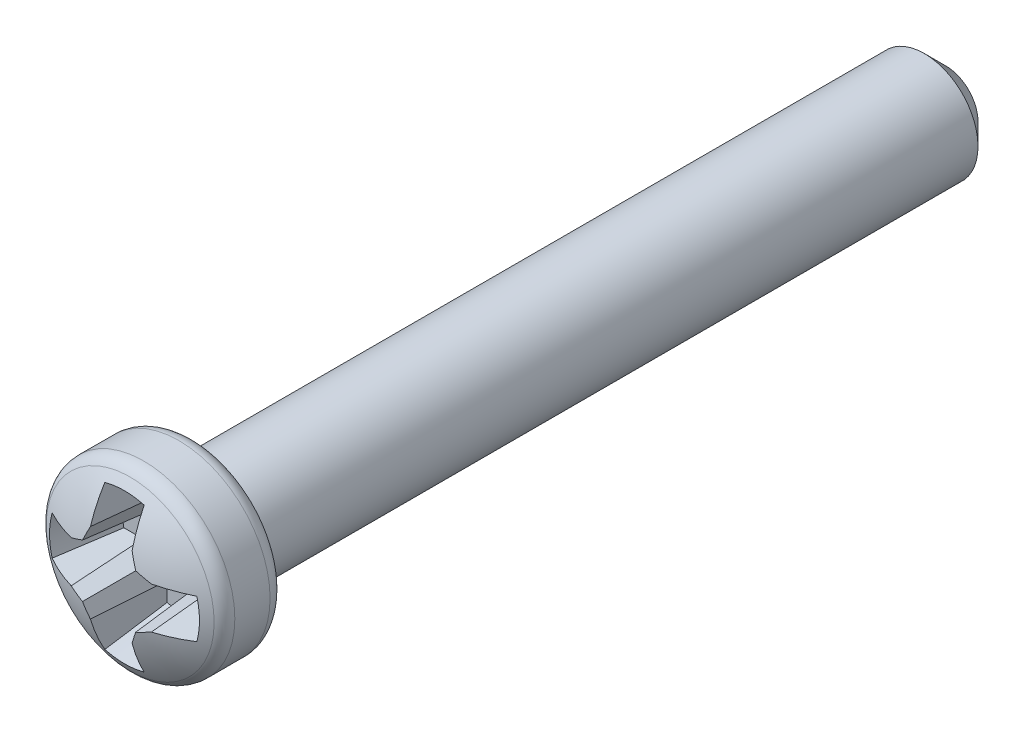
ISO-10303-21;
HEADER;
FILE_DESCRIPTION(('STEP AP214'),'2;1');
FILE_NAME('part.step','',(''),(''),'','','');
FILE_SCHEMA(('AUTOMOTIVE_DESIGN { 1 0 10303 214 1 1 1 1 }'));
ENDSEC;
DATA;
#1=APPLICATION_CONTEXT('core data for automotive mechanical design processes');
#2=APPLICATION_PROTOCOL_DEFINITION('international standard','automotive_design',2000,#1);
#3=PRODUCT_CONTEXT('',#1,'mechanical');
#4=PRODUCT('Part','Part','',(#3));
#5=PRODUCT_RELATED_PRODUCT_CATEGORY('part','',(#4));
#6=PRODUCT_DEFINITION_FORMATION('','',#4);
#7=PRODUCT_DEFINITION_CONTEXT('part definition',#1,'design');
#8=PRODUCT_DEFINITION('design','',#6,#7);
#9=PRODUCT_DEFINITION_SHAPE('','',#8);
#10=(LENGTH_UNIT() NAMED_UNIT(*) SI_UNIT(.MILLI.,.METRE.));
#11=(NAMED_UNIT(*) PLANE_ANGLE_UNIT() SI_UNIT($,.RADIAN.));
#12=(NAMED_UNIT(*) SI_UNIT($,.STERADIAN.) SOLID_ANGLE_UNIT());
#13=UNCERTAINTY_MEASURE_WITH_UNIT(LENGTH_MEASURE(1.E-05),#10,'distance_accuracy_value','');
#14=(GEOMETRIC_REPRESENTATION_CONTEXT(3) GLOBAL_UNCERTAINTY_ASSIGNED_CONTEXT((#13)) GLOBAL_UNIT_ASSIGNED_CONTEXT((#10,
#11,#12)) REPRESENTATION_CONTEXT('',''));
#15=CARTESIAN_POINT('',(0.,0.,0.));
#16=DIRECTION('',(0.,0.,1.));
#17=DIRECTION('',(1.,0.,0.));
#18=AXIS2_PLACEMENT_3D('',#15,#16,#17);
#19=CARTESIAN_POINT('',(-0.400000000000011,0.,15.7));
#20=DIRECTION('',(0.996194698091745,0.,0.0871557427476592));
#21=DIRECTION('',(0.,-1.,-1.20531199141214E-13));
#22=AXIS2_PLACEMENT_3D('',#19,#20,#21);
#23=PLANE('',#22);
#24=CARTESIAN_POINT('',(-0.155769339122426,0.,12.9084307722313));
#25=DIRECTION('',(0.996194698091745,0.,0.0871557427476592));
#26=DIRECTION('',(0.0871557427476592,0.,-0.996194698091745));
#27=AXIS2_PLACEMENT_3D('',#24,#25,#26);
#28=CIRCLE('',#27,2.77353697814506);
#29=CARTESIAN_POINT('',(-0.366942453606423,1.34976675197879,15.3221505157205));
#30=VERTEX_POINT('',#29);
#31=CARTESIAN_POINT('',(-0.388548913673451,0.747722237309709,15.5691134843641));
#32=VERTEX_POINT('',#31);
#33=EDGE_CURVE('E315',#30,#32,#28,.T.);
#34=ORIENTED_EDGE('',*,*,#33,.T.);
#35=DIRECTION('',(-0.0871426484044404,0.0173337504938601,0.996045029063886));
#36=VECTOR('',#35,1.);
#37=CARTESIAN_POINT('',(-0.400815427513501,0.750162198617128,15.7093203791284));
#38=LINE('',#37,#36);
#39=CARTESIAN_POINT('',(-0.273578881205041,0.724853275973701,14.255));
#40=VERTEX_POINT('',#39);
#41=EDGE_CURVE('E11',#40,#32,#38,.T.);
#42=ORIENTED_EDGE('',*,*,#41,.F.);
#43=DIRECTION('',(0.,-1.,0.));
#44=VECTOR('',#43,1.);
#45=CARTESIAN_POINT('',(-0.273578881205049,0.,14.255));
#46=LINE('',#45,#44);
#47=CARTESIAN_POINT('',(-0.273578881205038,1.07866041768189,14.255));
#48=VERTEX_POINT('',#47);
#49=EDGE_CURVE('E397',#48,#40,#46,.T.);
#50=ORIENTED_EDGE('',*,*,#49,.F.);
#51=CARTESIAN_POINT('',(-0.273578881205038,1.07866041768189,14.255));
#52=CARTESIAN_POINT('',(-0.304698622172029,1.16909490040446,14.6107002669011));
#53=CARTESIAN_POINT('',(-0.335820104838195,1.25945048805327,14.9664204415149));
#54=CARTESIAN_POINT('',(-0.366942453606423,1.34976675197879,15.3221505157205));
#55=(BOUNDED_CURVE() B_SPLINE_CURVE(3,(#51,#52,#53,#54),.UNSPECIFIED.,.F.,
.F.) B_SPLINE_CURVE_WITH_KNOTS((4,4),(0.0101147351762878,0.0112197354916044),
.UNSPECIFIED.) CURVE() GEOMETRIC_REPRESENTATION_ITEM() RATIONAL_B_SPLINE_CURVE((1.,1.,1.,1.)) REPRESENTATION_ITEM(''));
#56=EDGE_CURVE('E339',#48,#30,#55,.T.);
#57=ORIENTED_EDGE('',*,*,#56,.T.);
#58=EDGE_LOOP('',(#34,#42,#50,#57));
#59=FACE_BOUND('',#58,.T.);
#60=ADVANCED_FACE('F16',(#59),#23,.T.);
#61=CARTESIAN_POINT('',(-0.606586399182272,0.251256313292342,15.7));
#62=DIRECTION('',(0.920363891963223,-0.381227206369657,0.0871557427476588));
#63=DIRECTION('',(0.,-0.222868776578235,-0.974848454082234));
#64=AXIS2_PLACEMENT_3D('',#61,#62,#63);
#65=PLANE('',#64);
#66=CARTESIAN_POINT('',(-0.379146146396833,0.157047475959057,12.8861548030787));
#67=DIRECTION('',(0.920363891963223,-0.381227206369658,0.0871557427476588));
#68=DIRECTION('',(0.382683432365094,0.923879532511285,0.));
#69=AXIS2_PLACEMENT_3D('',#66,#67,#68);
#70=CIRCLE('',#69,2.74722630506);
#71=CARTESIAN_POINT('',(-0.496473166513852,0.496473166513839,15.6098062018733));
#72=VERTEX_POINT('',#71);
#73=EDGE_CURVE('E428',#32,#72,#70,.T.);
#74=ORIENTED_EDGE('',*,*,#73,.T.);
#75=DIRECTION('',(-0.0666626913468326,0.0666626913468326,0.995546167269401));
#76=VECTOR('',#75,1.);
#77=CARTESIAN_POINT('',(-0.5018585599701,0.501858559970086,15.6902321148732));
#78=LINE('',#77,#76);
#79=CARTESIAN_POINT('',(-0.405754091256932,0.405754091256919,14.255));
#80=VERTEX_POINT('',#79);
#81=EDGE_CURVE('E27',#80,#72,#78,.T.);
#82=ORIENTED_EDGE('',*,*,#81,.F.);
#83=DIRECTION('',(-0.382683432365094,-0.923879532511285,0.));
#84=VECTOR('',#83,1.);
#85=CARTESIAN_POINT('',(-0.489788515050423,0.202877045628466,14.255));
#86=LINE('',#85,#84);
#87=EDGE_CURVE('E244',#40,#80,#86,.T.);
#88=ORIENTED_EDGE('',*,*,#87,.F.);
#89=ORIENTED_EDGE('',*,*,#41,.T.);
#90=EDGE_LOOP('',(#74,#82,#88,#89));
#91=FACE_BOUND('',#90,.T.);
#92=ADVANCED_FACE('F504',(#91),#65,.T.);
#93=CARTESIAN_POINT('',(-0.251256313292353,0.606586399182252,15.7));
#94=DIRECTION('',(0.381227206369636,-0.920363891963232,0.0871557427476579));
#95=DIRECTION('',(0.,-0.0942752822069807,-0.995546167269401));
#96=AXIS2_PLACEMENT_3D('',#93,#94,#95);
#97=PLANE('',#96);
#98=CARTESIAN_POINT('',(-0.157047475959054,0.379146146396823,12.8861548030787));
#99=DIRECTION('',(0.381227206369636,-0.920363891963232,0.0871557427476579));
#100=DIRECTION('',(0.923879532511294,0.382683432365072,0.));
#101=AXIS2_PLACEMENT_3D('',#98,#99,#100);
#102=CIRCLE('',#101,2.74722630506);
#103=CARTESIAN_POINT('',(-0.747722237309725,0.388548913673444,15.5691134843641));
#104=VERTEX_POINT('',#103);
#105=EDGE_CURVE('E422',#72,#104,#102,.T.);
#106=ORIENTED_EDGE('',*,*,#105,.T.);
#107=DIRECTION('',(-0.0173337504938597,0.087142648404439,0.996045029063886));
#108=VECTOR('',#107,1.);
#109=CARTESIAN_POINT('',(-0.74977465582037,0.398867118306383,15.6870511029892));
#110=LINE('',#109,#108);
#111=CARTESIAN_POINT('',(-0.724853275973718,0.273578881205036,14.255));
#112=VERTEX_POINT('',#111);
#113=EDGE_CURVE('E222',#112,#104,#110,.T.);
#114=ORIENTED_EDGE('',*,*,#113,.F.);
#115=DIRECTION('',(-0.923879532511294,-0.382683432365072,0.));
#116=VECTOR('',#115,1.);
#117=CARTESIAN_POINT('',(-0.20287704562845,0.489788515050416,14.255));
#118=LINE('',#117,#116);
#119=EDGE_CURVE('E237',#80,#112,#118,.T.);
#120=ORIENTED_EDGE('',*,*,#119,.F.);
#121=ORIENTED_EDGE('',*,*,#81,.T.);
#122=EDGE_LOOP('',(#106,#114,#120,#121));
#123=FACE_BOUND('',#122,.T.);
#124=ADVANCED_FACE('F509',(#123),#97,.T.);
#125=CARTESIAN_POINT('',(0.,0.399999999999987,15.7));
#126=DIRECTION('',(0.,-0.996194698091746,0.0871557427476576));
#127=DIRECTION('',(-1.,0.,0.));
#128=AXIS2_PLACEMENT_3D('',#125,#126,#127);
#129=PLANE('',#128);
#130=CARTESIAN_POINT('',(0.,0.155769339122407,12.9084307722313));
#131=DIRECTION('',(0.,-0.996194698091746,0.0871557427476576));
#132=DIRECTION('',(0.,-0.0871557427476576,-0.996194698091746));
#133=AXIS2_PLACEMENT_3D('',#130,#131,#132);
#134=CIRCLE('',#133,2.77353697814506);
#135=CARTESIAN_POINT('',(-1.3497667519788,0.366942453606429,15.3221505157205));
#136=VERTEX_POINT('',#135);
#137=EDGE_CURVE('E217',#104,#136,#134,.T.);
#138=ORIENTED_EDGE('',*,*,#137,.T.);
#139=CARTESIAN_POINT('',(-1.07866041768188,0.273578881205039,14.255));
#140=CARTESIAN_POINT('',(-1.16909490040445,0.304698622172032,14.6107002669011));
#141=CARTESIAN_POINT('',(-1.25945048805327,0.335820104838199,14.9664204415149));
#142=CARTESIAN_POINT('',(-1.3497667519788,0.366942453606429,15.3221505157205));
#143=(BOUNDED_CURVE() B_SPLINE_CURVE(3,(#139,#140,#141,#142),.UNSPECIFIED.,.F.,
.F.) B_SPLINE_CURVE_WITH_KNOTS((4,4),(0.00303333154714993,0.00413833274330227),
.UNSPECIFIED.) CURVE() GEOMETRIC_REPRESENTATION_ITEM() RATIONAL_B_SPLINE_CURVE((1.,1.,1.,1.)) REPRESENTATION_ITEM(''));
#144=CARTESIAN_POINT('',(-1.07866041768188,0.273578881205039,14.255));
#145=VERTEX_POINT('',#144);
#146=EDGE_CURVE('E210',#145,#136,#143,.T.);
#147=ORIENTED_EDGE('',*,*,#146,.F.);
#148=DIRECTION('',(-1.,0.,0.));
#149=VECTOR('',#148,1.);
#150=CARTESIAN_POINT('',(0.,0.273578881205028,14.255));
#151=LINE('',#150,#149);
#152=EDGE_CURVE('E214',#112,#145,#151,.T.);
#153=ORIENTED_EDGE('',*,*,#152,.F.);
#154=ORIENTED_EDGE('',*,*,#113,.T.);
#155=EDGE_LOOP('',(#138,#147,#153,#154));
#156=FACE_BOUND('',#155,.T.);
#157=ADVANCED_FACE('F212',(#156),#129,.T.);
#158=CARTESIAN_POINT('',(0.,0.,15.7));
#159=DIRECTION('',(0.,0.,1.));
#160=DIRECTION('',(-1.,0.,0.));
#161=AXIS2_PLACEMENT_3D('',#158,#159,#160);
#162=CONICAL_SURFACE('',#161,1.5,0.26179938779915);
#163=CARTESIAN_POINT('',(0.,0.,15.3221505157205));
#164=DIRECTION('',(0.,0.,1.));
#165=DIRECTION('',(-1.,0.,0.));
#166=AXIS2_PLACEMENT_3D('',#163,#164,#165);
#167=CIRCLE('',#166,1.39875553582679);
#168=CARTESIAN_POINT('',(-1.3497667519788,-0.36694245360644,15.3221505157205));
#169=VERTEX_POINT('',#168);
#170=EDGE_CURVE('E411',#136,#169,#167,.T.);
#171=ORIENTED_EDGE('',*,*,#170,.T.);
#172=CARTESIAN_POINT('',(-1.07866041768189,-0.273578881205053,14.255));
#173=CARTESIAN_POINT('',(-1.16909490040446,-0.304698622172045,14.6107002669011));
#174=CARTESIAN_POINT('',(-1.25945048805328,-0.335820104838211,14.9664204415149));
#175=CARTESIAN_POINT('',(-1.3497667519788,-0.36694245360644,15.3221505157205));
#176=(BOUNDED_CURVE() B_SPLINE_CURVE(3,(#172,#173,#174,#175),.UNSPECIFIED.,.F.,
.F.) B_SPLINE_CURVE_WITH_KNOTS((4,4),(0.0101147351762878,0.0112197354916044),
.UNSPECIFIED.) CURVE() GEOMETRIC_REPRESENTATION_ITEM() RATIONAL_B_SPLINE_CURVE((1.,1.,1.,1.)) REPRESENTATION_ITEM(''));
#177=CARTESIAN_POINT('',(-1.07866041768189,-0.273578881205053,14.255));
#178=VERTEX_POINT('',#177);
#179=EDGE_CURVE('E223',#178,#169,#176,.T.);
#180=ORIENTED_EDGE('',*,*,#179,.F.);
#181=CARTESIAN_POINT('',(0.,0.,14.255));
#182=DIRECTION('',(0.,0.,1.));
#183=DIRECTION('',(1.,0.,0.));
#184=AXIS2_PLACEMENT_3D('',#181,#182,#183);
#185=CIRCLE('',#184,1.11281341693703);
#186=EDGE_CURVE('E226',#145,#178,#185,.T.);
#187=ORIENTED_EDGE('',*,*,#186,.F.);
#188=ORIENTED_EDGE('',*,*,#146,.T.);
#189=EDGE_LOOP('',(#171,#180,#187,#188));
#190=FACE_BOUND('',#189,.T.);
#191=ADVANCED_FACE('F227',(#190),#162,.F.);
#192=CARTESIAN_POINT('',(0.,-0.400000000000023,15.7));
#193=DIRECTION('',(0.,0.996194698091745,0.08715574274766));
#194=DIRECTION('',(1.,0.,0.));
#195=AXIS2_PLACEMENT_3D('',#192,#193,#194);
#196=PLANE('',#195);
#197=CARTESIAN_POINT('',(0.,-0.155769339122436,12.9084307722313));
#198=DIRECTION('',(0.,0.996194698091745,0.08715574274766));
#199=DIRECTION('',(0.,-0.08715574274766,0.996194698091745));
#200=AXIS2_PLACEMENT_3D('',#197,#198,#199);
#201=CIRCLE('',#200,2.77353697814506);
#202=CARTESIAN_POINT('',(-0.74772223730972,-0.388548913673466,15.5691134843641));
#203=VERTEX_POINT('',#202);
#204=EDGE_CURVE('E407',#169,#203,#201,.T.);
#205=ORIENTED_EDGE('',*,*,#204,.T.);
#206=DIRECTION('',(-0.0173337504938606,-0.0871426484044413,0.996045029063886));
#207=VECTOR('',#206,1.);
#208=CARTESIAN_POINT('',(-0.75016219861714,-0.400815427513517,15.7093203791284));
#209=LINE('',#208,#207);
#210=CARTESIAN_POINT('',(-0.724853275973712,-0.273578881205055,14.255));
#211=VERTEX_POINT('',#210);
#212=EDGE_CURVE('E303',#211,#203,#209,.T.);
#213=ORIENTED_EDGE('',*,*,#212,.F.);
#214=DIRECTION('',(1.,0.,0.));
#215=VECTOR('',#214,1.);
#216=CARTESIAN_POINT('',(0.,-0.27357888120506,14.255));
#217=LINE('',#216,#215);
#218=EDGE_CURVE('E232',#178,#211,#217,.T.);
#219=ORIENTED_EDGE('',*,*,#218,.F.);
#220=ORIENTED_EDGE('',*,*,#179,.T.);
#221=EDGE_LOOP('',(#205,#213,#219,#220));
#222=FACE_BOUND('',#221,.T.);
#223=ADVANCED_FACE('F818',(#222),#196,.T.);
#224=CARTESIAN_POINT('',(-0.251256313292352,-0.606586399182285,15.7));
#225=DIRECTION('',(0.381227206369654,0.920363891963224,0.0871557427476598));
#226=DIRECTION('',(0.22286877657824,0.,-0.974848454082233));
#227=AXIS2_PLACEMENT_3D('',#224,#225,#226);
#228=PLANE('',#227);
#229=CARTESIAN_POINT('',(-0.157047475959065,-0.379146146396845,12.8861548030787));
#230=DIRECTION('',(0.381227206369653,0.920363891963224,0.0871557427476598));
#231=DIRECTION('',(-0.923879532511287,0.38268343236509,0.));
#232=AXIS2_PLACEMENT_3D('',#229,#230,#231);
#233=CIRCLE('',#232,2.74722630506);
#234=CARTESIAN_POINT('',(-0.49647316651385,-0.496473166513867,15.6098062018733));
#235=VERTEX_POINT('',#234);
#236=EDGE_CURVE('E412',#203,#235,#233,.T.);
#237=ORIENTED_EDGE('',*,*,#236,.T.);
#238=DIRECTION('',(-0.0666626913468331,-0.0666626913468336,0.995546167269401));
#239=VECTOR('',#238,1.);
#240=CARTESIAN_POINT('',(-0.501858559970097,-0.501858559970114,15.6902321148732));
#241=LINE('',#240,#239);
#242=CARTESIAN_POINT('',(-0.405754091256929,-0.405754091256945,14.255));
#243=VERTEX_POINT('',#242);
#244=EDGE_CURVE('E261',#243,#235,#241,.T.);
#245=ORIENTED_EDGE('',*,*,#244,.F.);
#246=DIRECTION('',(0.923879532511287,-0.38268343236509,0.));
#247=VECTOR('',#246,1.);
#248=CARTESIAN_POINT('',(-0.20287704562847,-0.489788515050438,14.255));
#249=LINE('',#248,#247);
#250=EDGE_CURVE('E252',#211,#243,#249,.T.);
#251=ORIENTED_EDGE('',*,*,#250,.F.);
#252=ORIENTED_EDGE('',*,*,#212,.T.);
#253=EDGE_LOOP('',(#237,#245,#251,#252));
#254=FACE_BOUND('',#253,.T.);
#255=ADVANCED_FACE('F586',(#254),#228,.T.);
#256=CARTESIAN_POINT('',(-0.606586399182264,-0.251256313292368,15.7));
#257=DIRECTION('',(0.920363891963231,0.381227206369638,0.087155742747659));
#258=DIRECTION('',(0.,0.222868776578246,-0.974848454082231));
#259=AXIS2_PLACEMENT_3D('',#256,#257,#258);
#260=PLANE('',#259);
#261=CARTESIAN_POINT('',(-0.379146146396833,-0.157047475959064,12.8861548030787));
#262=DIRECTION('',(0.92036389196323,0.381227206369639,0.087155742747659));
#263=DIRECTION('',(-0.382683432365075,0.923879532511293,0.));
#264=AXIS2_PLACEMENT_3D('',#261,#262,#263);
#265=CIRCLE('',#264,2.74722630506);
#266=CARTESIAN_POINT('',(-0.388548913673453,-0.747722237309739,15.5691134843641));
#267=VERTEX_POINT('',#266);
#268=EDGE_CURVE('E20',#235,#267,#265,.T.);
#269=ORIENTED_EDGE('',*,*,#268,.T.);
#270=DIRECTION('',(-0.0871426484044398,-0.0173337504938608,0.996045029063886));
#271=VECTOR('',#270,1.);
#272=CARTESIAN_POINT('',(-0.398867118306393,-0.749774655820384,15.6870511029892));
#273=LINE('',#272,#271);
#274=CARTESIAN_POINT('',(-0.273578881205045,-0.724853275973731,14.255));
#275=VERTEX_POINT('',#274);
#276=EDGE_CURVE('E257',#275,#267,#273,.T.);
#277=ORIENTED_EDGE('',*,*,#276,.F.);
#278=DIRECTION('',(0.382683432365075,-0.923879532511293,0.));
#279=VECTOR('',#278,1.);
#280=CARTESIAN_POINT('',(-0.48978851505043,-0.202877045628457,14.255));
#281=LINE('',#280,#279);
#282=EDGE_CURVE('E256',#243,#275,#281,.T.);
#283=ORIENTED_EDGE('',*,*,#282,.F.);
#284=ORIENTED_EDGE('',*,*,#244,.T.);
#285=EDGE_LOOP('',(#269,#277,#283,#284));
#286=FACE_BOUND('',#285,.T.);
#287=ADVANCED_FACE('F583',(#286),#260,.T.);
#288=CARTESIAN_POINT('',(-0.4,0.,15.7));
#289=DIRECTION('',(0.996194698091746,0.,0.0871557427476584));
#290=DIRECTION('',(0.,-1.,0.));
#291=AXIS2_PLACEMENT_3D('',#288,#289,#290);
#292=PLANE('',#291);
#293=CARTESIAN_POINT('',(-0.155769339122418,0.,12.9084307722313));
#294=DIRECTION('',(0.996194698091746,0.,0.0871557427476584));
#295=DIRECTION('',(0.0871557427476584,0.,-0.996194698091746));
#296=AXIS2_PLACEMENT_3D('',#293,#294,#295);
#297=CIRCLE('',#296,2.77353697814506);
#298=CARTESIAN_POINT('',(-0.366942453606437,-1.34976675197881,15.3221505157205));
#299=VERTEX_POINT('',#298);
#300=EDGE_CURVE('E379',#267,#299,#297,.T.);
#301=ORIENTED_EDGE('',*,*,#300,.T.);
#302=CARTESIAN_POINT('',(-0.273578881205047,-1.07866041768189,14.255));
#303=CARTESIAN_POINT('',(-0.304698622172039,-1.16909490040447,14.6107002669011));
#304=CARTESIAN_POINT('',(-0.335820104838207,-1.25945048805328,14.9664204415149));
#305=CARTESIAN_POINT('',(-0.366942453606437,-1.34976675197881,15.3221505157205));
#306=(BOUNDED_CURVE() B_SPLINE_CURVE(3,(#302,#303,#304,#305),.UNSPECIFIED.,.F.,
.F.) B_SPLINE_CURVE_WITH_KNOTS((4,4),(0.00303333154714993,0.00413833274330227),
.UNSPECIFIED.) CURVE() GEOMETRIC_REPRESENTATION_ITEM() RATIONAL_B_SPLINE_CURVE((1.,1.,1.,1.)) REPRESENTATION_ITEM(''));
#307=CARTESIAN_POINT('',(-0.273578881205047,-1.07866041768189,14.255));
#308=VERTEX_POINT('',#307);
#309=EDGE_CURVE('E384',#308,#299,#306,.T.);
#310=ORIENTED_EDGE('',*,*,#309,.F.);
#311=DIRECTION('',(0.,-1.,0.));
#312=VECTOR('',#311,1.);
#313=CARTESIAN_POINT('',(-0.27357888120504,0.,14.255));
#314=LINE('',#313,#312);
#315=EDGE_CURVE('E413',#275,#308,#314,.T.);
#316=ORIENTED_EDGE('',*,*,#315,.F.);
#317=ORIENTED_EDGE('',*,*,#276,.T.);
#318=EDGE_LOOP('',(#301,#310,#316,#317));
#319=FACE_BOUND('',#318,.T.);
#320=ADVANCED_FACE('F585',(#319),#292,.T.);
#321=CARTESIAN_POINT('',(0.400000000000011,0.,15.7));
#322=DIRECTION('',(-0.996194698091745,0.,0.0871557427476592));
#323=DIRECTION('',(0.,1.,0.));
#324=AXIS2_PLACEMENT_3D('',#321,#322,#323);
#325=PLANE('',#324);
#326=CARTESIAN_POINT('',(0.155769339122426,0.,12.9084307722313));
#327=DIRECTION('',(-0.996194698091745,0.,0.0871557427476592));
#328=DIRECTION('',(0.0871557427476592,0.,0.996194698091745));
#329=AXIS2_PLACEMENT_3D('',#326,#327,#328);
#330=CIRCLE('',#329,2.77353697814506);
#331=CARTESIAN_POINT('',(0.366942453606433,-1.34976675197881,15.3221505157205));
#332=VERTEX_POINT('',#331);
#333=CARTESIAN_POINT('',(0.388548913673456,-0.747722237309731,15.5691134843641));
#334=VERTEX_POINT('',#333);
#335=EDGE_CURVE('E360',#332,#334,#330,.T.);
#336=ORIENTED_EDGE('',*,*,#335,.T.);
#337=DIRECTION('',(0.0871426484044404,-0.0173337504938611,0.996045029063886));
#338=VECTOR('',#337,1.);
#339=CARTESIAN_POINT('',(0.400815427513507,-0.750162198617151,15.7093203791284));
#340=LINE('',#339,#338);
#341=CARTESIAN_POINT('',(0.273578881205046,-0.724853275973723,14.255));
#342=VERTEX_POINT('',#341);
#343=EDGE_CURVE('E262',#342,#334,#340,.T.);
#344=ORIENTED_EDGE('',*,*,#343,.F.);
#345=DIRECTION('',(0.,1.,0.));
#346=VECTOR('',#345,1.);
#347=CARTESIAN_POINT('',(0.273578881205049,0.,14.255));
#348=LINE('',#347,#346);
#349=CARTESIAN_POINT('',(0.273578881205045,-1.0786604176819,14.255));
#350=VERTEX_POINT('',#349);
#351=EDGE_CURVE('E353',#350,#342,#348,.T.);
#352=ORIENTED_EDGE('',*,*,#351,.F.);
#353=CARTESIAN_POINT('',(0.273578881205045,-1.0786604176819,14.255));
#354=CARTESIAN_POINT('',(0.304698622172037,-1.16909490040448,14.6107002669011));
#355=CARTESIAN_POINT('',(0.335820104838204,-1.25945048805329,14.9664204415149));
#356=CARTESIAN_POINT('',(0.366942453606433,-1.34976675197881,15.3221505157205));
#357=(BOUNDED_CURVE() B_SPLINE_CURVE(3,(#353,#354,#355,#356),.UNSPECIFIED.,.F.,
.F.) B_SPLINE_CURVE_WITH_KNOTS((4,4),(0.0101147351762878,0.0112197354916044),
.UNSPECIFIED.) CURVE() GEOMETRIC_REPRESENTATION_ITEM() RATIONAL_B_SPLINE_CURVE((1.,1.,1.,1.)) REPRESENTATION_ITEM(''));
#358=EDGE_CURVE('E323',#350,#332,#357,.T.);
#359=ORIENTED_EDGE('',*,*,#358,.T.);
#360=EDGE_LOOP('',(#336,#344,#352,#359));
#361=FACE_BOUND('',#360,.T.);
#362=ADVANCED_FACE('F841',(#361),#325,.T.);
#363=CARTESIAN_POINT('',(0.606586399182273,-0.251256313292363,15.7));
#364=DIRECTION('',(-0.920363891963225,0.381227206369651,0.0871557427476594));
#365=DIRECTION('',(0.094275282206983,0.,0.995546167269401));
#366=AXIS2_PLACEMENT_3D('',#363,#364,#365);
#367=PLANE('',#366);
#368=CARTESIAN_POINT('',(0.379146146396836,-0.157047475959071,12.8861548030787));
#369=DIRECTION('',(-0.920363891963225,0.38122720636965,0.0871557427476594));
#370=DIRECTION('',(-0.382683432365087,-0.923879532511288,0.));
#371=AXIS2_PLACEMENT_3D('',#368,#369,#370);
#372=CIRCLE('',#371,2.74722630506);
#373=CARTESIAN_POINT('',(0.496473166513856,-0.496473166513861,15.6098062018733));
#374=VERTEX_POINT('',#373);
#375=EDGE_CURVE('E368',#334,#374,#372,.T.);
#376=ORIENTED_EDGE('',*,*,#375,.T.);
#377=DIRECTION('',(0.066662691346833,-0.0666626913468337,0.995546167269401));
#378=VECTOR('',#377,1.);
#379=CARTESIAN_POINT('',(0.501858559970103,-0.501858559970108,15.6902321148732));
#380=LINE('',#379,#378);
#381=CARTESIAN_POINT('',(0.405754091256935,-0.405754091256939,14.255));
#382=VERTEX_POINT('',#381);
#383=EDGE_CURVE('E41',#382,#374,#380,.T.);
#384=ORIENTED_EDGE('',*,*,#383,.F.);
#385=DIRECTION('',(0.382683432365087,0.923879532511288,0.));
#386=VECTOR('',#385,1.);
#387=CARTESIAN_POINT('',(0.489788515050433,-0.202877045628466,14.255));
#388=LINE('',#387,#386);
#389=EDGE_CURVE('E348',#342,#382,#388,.T.);
#390=ORIENTED_EDGE('',*,*,#389,.F.);
#391=ORIENTED_EDGE('',*,*,#343,.T.);
#392=EDGE_LOOP('',(#376,#384,#390,#391));
#393=FACE_BOUND('',#392,.T.);
#394=ADVANCED_FACE('F839',(#393),#367,.T.);
#395=CARTESIAN_POINT('',(0.251256313292357,-0.606586399182276,15.7));
#396=DIRECTION('',(-0.381227206369642,0.920363891963229,0.0871557427476594));
#397=DIRECTION('',(0.222868776578245,0.,0.974848454082231));
#398=AXIS2_PLACEMENT_3D('',#395,#396,#397);
#399=PLANE('',#398);
#400=CARTESIAN_POINT('',(0.157047475959058,-0.379146146396842,12.8861548030787));
#401=DIRECTION('',(-0.381227206369641,0.920363891963229,0.0871557427476594));
#402=DIRECTION('',(-0.923879532511292,-0.382683432365078,0.));
#403=AXIS2_PLACEMENT_3D('',#400,#401,#402);
#404=CIRCLE('',#403,2.74722630506);
#405=CARTESIAN_POINT('',(0.747722237309727,-0.388548913673463,15.5691134843641));
#406=VERTEX_POINT('',#405);
#407=EDGE_CURVE('E272',#374,#406,#404,.T.);
#408=ORIENTED_EDGE('',*,*,#407,.T.);
#409=DIRECTION('',(0.0173337504938603,-0.0871426484044405,0.996045029063886));
#410=VECTOR('',#409,1.);
#411=CARTESIAN_POINT('',(0.749774655820373,-0.398867118306403,15.6870511029892));
#412=LINE('',#411,#410);
#413=CARTESIAN_POINT('',(0.72485327597372,-0.273578881205054,14.255));
#414=VERTEX_POINT('',#413);
#415=EDGE_CURVE('E282',#414,#406,#412,.T.);
#416=ORIENTED_EDGE('',*,*,#415,.F.);
#417=DIRECTION('',(0.923879532511292,0.382683432365078,0.));
#418=VECTOR('',#417,1.);
#419=CARTESIAN_POINT('',(0.202877045628462,-0.489788515050434,14.255));
#420=LINE('',#419,#418);
#421=EDGE_CURVE('E352',#382,#414,#420,.T.);
#422=ORIENTED_EDGE('',*,*,#421,.F.);
#423=ORIENTED_EDGE('',*,*,#383,.T.);
#424=EDGE_LOOP('',(#408,#416,#422,#423));
#425=FACE_BOUND('',#424,.T.);
#426=ADVANCED_FACE('F829',(#425),#399,.T.);
#427=CARTESIAN_POINT('',(0.,-0.400000000000013,15.7));
#428=DIRECTION('',(0.,0.996194698091745,0.0871557427476592));
#429=DIRECTION('',(1.,0.,0.));
#430=AXIS2_PLACEMENT_3D('',#427,#428,#429);
#431=PLANE('',#430);
#432=CARTESIAN_POINT('',(0.,-0.155769339122428,12.9084307722313));
#433=DIRECTION('',(0.,0.996194698091745,0.0871557427476592));
#434=DIRECTION('',(0.,-0.0871557427476592,0.996194698091745));
#435=AXIS2_PLACEMENT_3D('',#432,#433,#434);
#436=CIRCLE('',#435,2.77353697814506);
#437=CARTESIAN_POINT('',(1.3497667519788,-0.366942453606444,15.3221505157205));
#438=VERTEX_POINT('',#437);
#439=EDGE_CURVE('E268',#406,#438,#436,.T.);
#440=ORIENTED_EDGE('',*,*,#439,.T.);
#441=CARTESIAN_POINT('',(1.07866041768188,-0.273578881205055,14.255));
#442=CARTESIAN_POINT('',(1.16909490040446,-0.304698622172047,14.6107002669011));
#443=CARTESIAN_POINT('',(1.25945048805327,-0.335820104838214,14.9664204415149));
#444=CARTESIAN_POINT('',(1.3497667519788,-0.366942453606444,15.3221505157205));
#445=(BOUNDED_CURVE() B_SPLINE_CURVE(3,(#441,#442,#443,#444),.UNSPECIFIED.,.F.,
.F.) B_SPLINE_CURVE_WITH_KNOTS((4,4),(0.00303333154714993,0.00413833274330227),
.UNSPECIFIED.) CURVE() GEOMETRIC_REPRESENTATION_ITEM() RATIONAL_B_SPLINE_CURVE((1.,1.,1.,1.)) REPRESENTATION_ITEM(''));
#446=CARTESIAN_POINT('',(1.07866041768188,-0.273578881205055,14.255));
#447=VERTEX_POINT('',#446);
#448=EDGE_CURVE('E322',#447,#438,#445,.T.);
#449=ORIENTED_EDGE('',*,*,#448,.F.);
#450=DIRECTION('',(1.,0.,0.));
#451=VECTOR('',#450,1.);
#452=CARTESIAN_POINT('',(0.,-0.273578881205051,14.255));
#453=LINE('',#452,#451);
#454=EDGE_CURVE('E330',#414,#447,#453,.T.);
#455=ORIENTED_EDGE('',*,*,#454,.F.);
#456=ORIENTED_EDGE('',*,*,#415,.T.);
#457=EDGE_LOOP('',(#440,#449,#455,#456));
#458=FACE_BOUND('',#457,.T.);
#459=ADVANCED_FACE('F599',(#458),#431,.T.);
#460=CARTESIAN_POINT('',(0.,0.,14.255));
#461=DIRECTION('',(0.,0.,1.));
#462=DIRECTION('',(1.,0.,0.));
#463=AXIS2_PLACEMENT_3D('',#460,#461,#462);
#464=PLANE('',#463);
#465=ORIENTED_EDGE('',*,*,#454,.T.);
#466=CARTESIAN_POINT('',(0.,0.,14.255));
#467=DIRECTION('',(0.,0.,1.));
#468=DIRECTION('',(1.,0.,0.));
#469=AXIS2_PLACEMENT_3D('',#466,#467,#468);
#470=CIRCLE('',#469,1.11281341693703);
#471=CARTESIAN_POINT('',(1.07866041768189,0.273578881205037,14.255));
#472=VERTEX_POINT('',#471);
#473=EDGE_CURVE('E318',#447,#472,#470,.T.);
#474=ORIENTED_EDGE('',*,*,#473,.T.);
#475=DIRECTION('',(-1.,0.,0.));
#476=VECTOR('',#475,1.);
#477=CARTESIAN_POINT('',(0.,0.273578881205037,14.255));
#478=LINE('',#477,#476);
#479=CARTESIAN_POINT('',(0.72485327597371,0.273578881205037,14.255));
#480=VERTEX_POINT('',#479);
#481=EDGE_CURVE('E327',#472,#480,#478,.T.);
#482=ORIENTED_EDGE('',*,*,#481,.T.);
#483=DIRECTION('',(-0.923879532511289,0.382683432365084,0.));
#484=VECTOR('',#483,1.);
#485=CARTESIAN_POINT('',(0.202877045628459,0.489788515050419,14.255));
#486=LINE('',#485,#484);
#487=CARTESIAN_POINT('',(0.405754091256926,0.405754091256924,14.255));
#488=VERTEX_POINT('',#487);
#489=EDGE_CURVE('E248',#480,#488,#486,.T.);
#490=ORIENTED_EDGE('',*,*,#489,.T.);
#491=DIRECTION('',(-0.382683432365081,0.92387953251129,0.));
#492=VECTOR('',#491,1.);
#493=CARTESIAN_POINT('',(0.48978851505042,0.202877045628457,14.255));
#494=LINE('',#493,#492);
#495=CARTESIAN_POINT('',(0.273578881205039,0.724853275973709,14.255));
#496=VERTEX_POINT('',#495);
#497=EDGE_CURVE('E266',#488,#496,#494,.T.);
#498=ORIENTED_EDGE('',*,*,#497,.T.);
#499=DIRECTION('',(0.,1.,0.));
#500=VECTOR('',#499,1.);
#501=CARTESIAN_POINT('',(0.27357888120504,0.,14.255));
#502=LINE('',#501,#500);
#503=CARTESIAN_POINT('',(0.273578881205039,1.07866041768189,14.255));
#504=VERTEX_POINT('',#503);
#505=EDGE_CURVE('E267',#496,#504,#502,.T.);
#506=ORIENTED_EDGE('',*,*,#505,.T.);
#507=CARTESIAN_POINT('',(0.,0.,14.255));
#508=DIRECTION('',(0.,0.,1.));
#509=DIRECTION('',(1.,0.,0.));
#510=AXIS2_PLACEMENT_3D('',#507,#508,#509);
#511=CIRCLE('',#510,1.11281341693703);
#512=EDGE_CURVE('E288',#504,#48,#511,.T.);
#513=ORIENTED_EDGE('',*,*,#512,.T.);
#514=ORIENTED_EDGE('',*,*,#49,.T.);
#515=ORIENTED_EDGE('',*,*,#87,.T.);
#516=ORIENTED_EDGE('',*,*,#119,.T.);
#517=ORIENTED_EDGE('',*,*,#152,.T.);
#518=ORIENTED_EDGE('',*,*,#186,.T.);
#519=ORIENTED_EDGE('',*,*,#218,.T.);
#520=ORIENTED_EDGE('',*,*,#250,.T.);
#521=ORIENTED_EDGE('',*,*,#282,.T.);
#522=ORIENTED_EDGE('',*,*,#315,.T.);
#523=CARTESIAN_POINT('',(0.,0.,14.255));
#524=DIRECTION('',(0.,0.,1.));
#525=DIRECTION('',(1.,0.,0.));
#526=AXIS2_PLACEMENT_3D('',#523,#524,#525);
#527=CIRCLE('',#526,1.11281341693703);
#528=EDGE_CURVE('E391',#308,#350,#527,.T.);
#529=ORIENTED_EDGE('',*,*,#528,.T.);
#530=ORIENTED_EDGE('',*,*,#351,.T.);
#531=ORIENTED_EDGE('',*,*,#389,.T.);
#532=ORIENTED_EDGE('',*,*,#421,.T.);
#533=EDGE_LOOP('',(#465,#474,#482,#490,#498,#506,#513,#514,#515,#516,#517,#518,#519,#520,#521,
#522,#529,#530,#531,#532));
#534=FACE_BOUND('',#533,.T.);
#535=ADVANCED_FACE('F234',(#534),#464,.T.);
#536=CARTESIAN_POINT('',(0.,0.4,15.7));
#537=DIRECTION('',(0.,-0.996194698091746,0.0871557427476584));
#538=DIRECTION('',(-1.,0.,0.));
#539=AXIS2_PLACEMENT_3D('',#536,#537,#538);
#540=PLANE('',#539);
#541=CARTESIAN_POINT('',(0.,0.155769339122415,12.9084307722313));
#542=DIRECTION('',(0.,-0.996194698091746,0.0871557427476584));
#543=DIRECTION('',(0.,-0.0871557427476584,-0.996194698091746));
#544=AXIS2_PLACEMENT_3D('',#541,#542,#543);
#545=CIRCLE('',#544,2.77353697814506);
#546=CARTESIAN_POINT('',(1.3497667519788,0.366942453606425,15.3221505157205));
#547=VERTEX_POINT('',#546);
#548=CARTESIAN_POINT('',(0.747722237309717,0.388548913673446,15.5691134843641));
#549=VERTEX_POINT('',#548);
#550=EDGE_CURVE('E402',#547,#549,#545,.T.);
#551=ORIENTED_EDGE('',*,*,#550,.T.);
#552=DIRECTION('',(0.0173337504938599,0.0871426484044397,0.996045029063886));
#553=VECTOR('',#552,1.);
#554=CARTESIAN_POINT('',(0.750162198617137,0.400815427513497,15.7093203791284));
#555=LINE('',#554,#553);
#556=EDGE_CURVE('E324',#480,#549,#555,.T.);
#557=ORIENTED_EDGE('',*,*,#556,.F.);
#558=ORIENTED_EDGE('',*,*,#481,.F.);
#559=CARTESIAN_POINT('',(1.07866041768189,0.273578881205037,14.255));
#560=CARTESIAN_POINT('',(1.16909490040446,0.304698622172029,14.6107002669011));
#561=CARTESIAN_POINT('',(1.25945048805327,0.335820104838196,14.9664204415149));
#562=CARTESIAN_POINT('',(1.3497667519788,0.366942453606425,15.3221505157205));
#563=(BOUNDED_CURVE() B_SPLINE_CURVE(3,(#559,#560,#561,#562),.UNSPECIFIED.,.F.,
.F.) B_SPLINE_CURVE_WITH_KNOTS((4,4),(0.0101147351762878,0.0112197354916044),
.UNSPECIFIED.) CURVE() GEOMETRIC_REPRESENTATION_ITEM() RATIONAL_B_SPLINE_CURVE((1.,1.,1.,1.)) REPRESENTATION_ITEM(''));
#564=EDGE_CURVE('E334',#472,#547,#563,.T.);
#565=ORIENTED_EDGE('',*,*,#564,.T.);
#566=EDGE_LOOP('',(#551,#557,#558,#565));
#567=FACE_BOUND('',#566,.T.);
#568=ADVANCED_FACE('F588',(#567),#540,.T.);
#569=CARTESIAN_POINT('',(0.251256313292348,0.606586399182262,15.7));
#570=DIRECTION('',(-0.381227206369648,-0.920363891963227,0.0871557427476584));
#571=DIRECTION('',(-0.923879532511289,0.382683432365084,0.));
#572=AXIS2_PLACEMENT_3D('',#569,#570,#571);
#573=PLANE('',#572);
#574=CARTESIAN_POINT('',(0.157047475959061,0.379146146396826,12.8861548030787));
#575=DIRECTION('',(-0.381227206369648,-0.920363891963227,0.0871557427476584));
#576=DIRECTION('',(0.923879532511289,-0.382683432365084,0.));
#577=AXIS2_PLACEMENT_3D('',#574,#575,#576);
#578=CIRCLE('',#577,2.74722630506);
#579=CARTESIAN_POINT('',(0.496473166513847,0.496473166513845,15.6098062018733));
#580=VERTEX_POINT('',#579);
#581=EDGE_CURVE('E398',#549,#580,#578,.T.);
#582=ORIENTED_EDGE('',*,*,#581,.T.);
#583=DIRECTION('',(0.0666626913468327,0.0666626913468325,0.995546167269401));
#584=VECTOR('',#583,1.);
#585=CARTESIAN_POINT('',(0.501858559970094,0.501858559970092,15.6902321148732));
#586=LINE('',#585,#584);
#587=EDGE_CURVE('E331',#488,#580,#586,.T.);
#588=ORIENTED_EDGE('',*,*,#587,.F.);
#589=ORIENTED_EDGE('',*,*,#489,.F.);
#590=ORIENTED_EDGE('',*,*,#556,.T.);
#591=EDGE_LOOP('',(#582,#588,#589,#590));
#592=FACE_BOUND('',#591,.T.);
#593=ADVANCED_FACE('F590',(#592),#573,.T.);
#594=CARTESIAN_POINT('',(0.606586399182262,0.251256313292347,15.7));
#595=DIRECTION('',(-0.920363891963228,-0.381227206369645,0.0871557427476583));
#596=DIRECTION('',(-0.382683432365081,0.92387953251129,0.));
#597=AXIS2_PLACEMENT_3D('',#594,#595,#596);
#598=PLANE('',#597);
#599=CARTESIAN_POINT('',(0.37914614639683,0.15704747595905,12.8861548030787));
#600=DIRECTION('',(-0.920363891963228,-0.381227206369645,0.0871557427476583));
#601=DIRECTION('',(0.382683432365081,-0.92387953251129,0.));
#602=AXIS2_PLACEMENT_3D('',#599,#600,#601);
#603=CIRCLE('',#602,2.74722630506);
#604=CARTESIAN_POINT('',(0.388548913673448,0.747722237309716,15.5691134843641));
#605=VERTEX_POINT('',#604);
#606=EDGE_CURVE('E403',#580,#605,#603,.T.);
#607=ORIENTED_EDGE('',*,*,#606,.T.);
#608=DIRECTION('',(0.0871426484044397,0.0173337504938598,0.996045029063886));
#609=VECTOR('',#608,1.);
#610=CARTESIAN_POINT('',(0.398867118306387,0.749774655820362,15.6870511029892));
#611=LINE('',#610,#609);
#612=EDGE_CURVE('E263',#496,#605,#611,.T.);
#613=ORIENTED_EDGE('',*,*,#612,.F.);
#614=ORIENTED_EDGE('',*,*,#497,.F.);
#615=ORIENTED_EDGE('',*,*,#587,.T.);
#616=EDGE_LOOP('',(#607,#613,#614,#615));
#617=FACE_BOUND('',#616,.T.);
#618=ADVANCED_FACE('F596',(#617),#598,.T.);
#619=CARTESIAN_POINT('',(0.4,0.,15.7));
#620=DIRECTION('',(-0.996194698091746,0.,0.0871557427476584));
#621=DIRECTION('',(0.,1.,0.));
#622=AXIS2_PLACEMENT_3D('',#619,#620,#621);
#623=PLANE('',#622);
#624=CARTESIAN_POINT('',(0.155769339122418,0.,12.9084307722313));
#625=DIRECTION('',(-0.996194698091746,0.,0.0871557427476584));
#626=DIRECTION('',(0.0871557427476584,0.,0.996194698091746));
#627=AXIS2_PLACEMENT_3D('',#624,#625,#626);
#628=CIRCLE('',#627,2.77353697814506);
#629=CARTESIAN_POINT('',(0.366942453606427,1.34976675197879,15.3221505157205));
#630=VERTEX_POINT('',#629);
#631=EDGE_CURVE('E297',#605,#630,#628,.T.);
#632=ORIENTED_EDGE('',*,*,#631,.T.);
#633=CARTESIAN_POINT('',(0.273578881205039,1.07866041768189,14.255));
#634=CARTESIAN_POINT('',(0.304698622172031,1.16909490040446,14.6107002669011));
#635=CARTESIAN_POINT('',(0.335820104838198,1.25945048805327,14.9664204415149));
#636=CARTESIAN_POINT('',(0.366942453606427,1.34976675197879,15.3221505157205));
#637=(BOUNDED_CURVE() B_SPLINE_CURVE(3,(#633,#634,#635,#636),.UNSPECIFIED.,.F.,
.F.) B_SPLINE_CURVE_WITH_KNOTS((4,4),(0.00303333154714993,0.00413833274330227),
.UNSPECIFIED.) CURVE() GEOMETRIC_REPRESENTATION_ITEM() RATIONAL_B_SPLINE_CURVE((1.,1.,1.,1.)) REPRESENTATION_ITEM(''));
#638=EDGE_CURVE('E283',#504,#630,#637,.T.);
#639=ORIENTED_EDGE('',*,*,#638,.F.);
#640=ORIENTED_EDGE('',*,*,#505,.F.);
#641=ORIENTED_EDGE('',*,*,#612,.T.);
#642=EDGE_LOOP('',(#632,#639,#640,#641));
#643=FACE_BOUND('',#642,.T.);
#644=ADVANCED_FACE('F856',(#643),#623,.T.);
#645=CARTESIAN_POINT('',(0.,0.,15.7));
#646=DIRECTION('',(0.,0.,1.));
#647=DIRECTION('',(1.,0.,0.));
#648=AXIS2_PLACEMENT_3D('',#645,#646,#647);
#649=CONICAL_SURFACE('',#648,1.5,0.26179938779915);
#650=CARTESIAN_POINT('',(0.,0.,15.3221505157205));
#651=DIRECTION('',(0.,0.,1.));
#652=DIRECTION('',(-1.,0.,0.));
#653=AXIS2_PLACEMENT_3D('',#650,#651,#652);
#654=CIRCLE('',#653,1.39875553582679);
#655=EDGE_CURVE('E293',#630,#30,#654,.T.);
#656=ORIENTED_EDGE('',*,*,#655,.T.);
#657=ORIENTED_EDGE('',*,*,#56,.F.);
#658=ORIENTED_EDGE('',*,*,#512,.F.);
#659=ORIENTED_EDGE('',*,*,#638,.T.);
#660=EDGE_LOOP('',(#656,#657,#658,#659));
#661=FACE_BOUND('',#660,.T.);
#662=ADVANCED_FACE('F18',(#661),#649,.F.);
#663=CARTESIAN_POINT('',(0.,0.,15.7));
#664=DIRECTION('',(0.,0.,1.));
#665=DIRECTION('',(1.,0.,0.));
#666=AXIS2_PLACEMENT_3D('',#663,#664,#665);
#667=CONICAL_SURFACE('',#666,1.5,0.26179938779915);
#668=ORIENTED_EDGE('',*,*,#473,.F.);
#669=ORIENTED_EDGE('',*,*,#448,.T.);
#670=CARTESIAN_POINT('',(0.,0.,15.3221505157205));
#671=DIRECTION('',(0.,0.,1.));
#672=DIRECTION('',(-1.,0.,0.));
#673=AXIS2_PLACEMENT_3D('',#670,#671,#672);
#674=CIRCLE('',#673,1.39875553582679);
#675=EDGE_CURVE('E273',#438,#547,#674,.T.);
#676=ORIENTED_EDGE('',*,*,#675,.T.);
#677=ORIENTED_EDGE('',*,*,#564,.F.);
#678=EDGE_LOOP('',(#668,#669,#676,#677));
#679=FACE_BOUND('',#678,.T.);
#680=ADVANCED_FACE('F565',(#679),#667,.F.);
#681=CARTESIAN_POINT('',(0.,0.,15.7));
#682=DIRECTION('',(0.,0.,1.));
#683=DIRECTION('',(0.,-1.,0.));
#684=AXIS2_PLACEMENT_3D('',#681,#682,#683);
#685=CONICAL_SURFACE('',#684,1.5,0.26179938779915);
#686=ORIENTED_EDGE('',*,*,#528,.F.);
#687=ORIENTED_EDGE('',*,*,#309,.T.);
#688=CARTESIAN_POINT('',(0.,0.,15.3221505157205));
#689=DIRECTION('',(0.,0.,1.));
#690=DIRECTION('',(0.,1.,0.));
#691=AXIS2_PLACEMENT_3D('',#688,#689,#690);
#692=CIRCLE('',#691,1.39875553582679);
#693=EDGE_CURVE('E367',#299,#332,#692,.T.);
#694=ORIENTED_EDGE('',*,*,#693,.T.);
#695=ORIENTED_EDGE('',*,*,#358,.F.);
#696=EDGE_LOOP('',(#686,#687,#694,#695));
#697=FACE_BOUND('',#696,.T.);
#698=ADVANCED_FACE('F555',(#697),#685,.F.);
#699=CARTESIAN_POINT('',(0.,0.,14.));
#700=DIRECTION('',(0.,0.,-1.));
#701=DIRECTION('',(0.,-1.,0.));
#702=AXIS2_PLACEMENT_3D('',#699,#700,#701);
#703=PLANE('',#702);
#704=CARTESIAN_POINT('',(0.,0.,14.));
#705=DIRECTION('',(0.,0.,1.));
#706=DIRECTION('',(1.,0.,0.));
#707=AXIS2_PLACEMENT_3D('',#704,#705,#706);
#708=CIRCLE('',#707,1.);
#709=CARTESIAN_POINT('',(-1.,0.,14.));
#710=VERTEX_POINT('',#709);
#711=EDGE_CURVE('E304',#710,#710,#708,.T.);
#712=ORIENTED_EDGE('',*,*,#711,.T.);
#713=EDGE_LOOP('',(#712));
#714=FACE_BOUND('',#713,.T.);
#715=CARTESIAN_POINT('',(0.,0.,14.));
#716=DIRECTION('',(0.,0.,1.));
#717=DIRECTION('',(-1.,0.,0.));
#718=AXIS2_PLACEMENT_3D('',#715,#716,#717);
#719=CIRCLE('',#718,1.394);
#720=CARTESIAN_POINT('',(-1.394,0.,14.));
#721=VERTEX_POINT('',#720);
#722=EDGE_CURVE('E314',#721,#721,#719,.T.);
#723=ORIENTED_EDGE('',*,*,#722,.F.);
#724=EDGE_LOOP('',(#723));
#725=FACE_BOUND('',#724,.T.);
#726=ADVANCED_FACE('F553',(#714,#725),#703,.T.);
#727=CARTESIAN_POINT('',(0.,0.,14.306));
#728=DIRECTION('',(0.,0.,1.));
#729=DIRECTION('',(1.,0.,0.));
#730=AXIS2_PLACEMENT_3D('',#727,#728,#729);
#731=TOROIDAL_SURFACE('',#730,1.394,0.306);
#732=CARTESIAN_POINT('',(0.,0.,14.306));
#733=DIRECTION('',(0.,0.,-1.));
#734=DIRECTION('',(-1.,0.,0.));
#735=AXIS2_PLACEMENT_3D('',#732,#733,#734);
#736=CIRCLE('',#735,1.7);
#737=CARTESIAN_POINT('',(1.7,0.,14.306));
#738=VERTEX_POINT('',#737);
#739=CARTESIAN_POINT('',(-1.7,0.,14.306));
#740=VERTEX_POINT('',#739);
#741=EDGE_CURVE('E470',#738,#740,#736,.T.);
#742=ORIENTED_EDGE('',*,*,#741,.T.);
#743=CARTESIAN_POINT('',(-1.394,0.,14.306));
#744=DIRECTION('',(0.,-1.,0.));
#745=DIRECTION('',(-1.,0.,0.));
#746=AXIS2_PLACEMENT_3D('',#743,#744,#745);
#747=CIRCLE('',#746,0.306);
#748=EDGE_CURVE('E310',#740,#721,#747,.T.);
#749=ORIENTED_EDGE('',*,*,#748,.T.);
#750=ORIENTED_EDGE('',*,*,#722,.T.);
#751=ORIENTED_EDGE('',*,*,#748,.F.);
#752=CARTESIAN_POINT('',(0.,0.,14.306));
#753=DIRECTION('',(0.,0.,-1.));
#754=DIRECTION('',(-1.,0.,0.));
#755=AXIS2_PLACEMENT_3D('',#752,#753,#754);
#756=CIRCLE('',#755,1.7);
#757=EDGE_CURVE('E298',#740,#738,#756,.T.);
#758=ORIENTED_EDGE('',*,*,#757,.T.);
#759=EDGE_LOOP('',(#742,#749,#750,#751,#758));
#760=FACE_BOUND('',#759,.T.);
#761=ADVANCED_FACE('F548',(#760),#731,.T.);
#762=CARTESIAN_POINT('',(0.,0.,12.9220588235294));
#763=DIRECTION('',(-1.,0.,0.));
#764=DIRECTION('',(0.,1.,0.));
#765=AXIS2_PLACEMENT_3D('',#762,#763,#764);
#766=SPHERICAL_SURFACE('',#765,2.7779411764706);
#767=ORIENTED_EDGE('',*,*,#655,.F.);
#768=ORIENTED_EDGE('',*,*,#631,.F.);
#769=ORIENTED_EDGE('',*,*,#606,.F.);
#770=ORIENTED_EDGE('',*,*,#581,.F.);
#771=ORIENTED_EDGE('',*,*,#550,.F.);
#772=ORIENTED_EDGE('',*,*,#675,.F.);
#773=ORIENTED_EDGE('',*,*,#439,.F.);
#774=ORIENTED_EDGE('',*,*,#407,.F.);
#775=ORIENTED_EDGE('',*,*,#375,.F.);
#776=ORIENTED_EDGE('',*,*,#335,.F.);
#777=ORIENTED_EDGE('',*,*,#693,.F.);
#778=ORIENTED_EDGE('',*,*,#300,.F.);
#779=ORIENTED_EDGE('',*,*,#268,.F.);
#780=ORIENTED_EDGE('',*,*,#236,.F.);
#781=ORIENTED_EDGE('',*,*,#204,.F.);
#782=ORIENTED_EDGE('',*,*,#170,.F.);
#783=ORIENTED_EDGE('',*,*,#137,.F.);
#784=ORIENTED_EDGE('',*,*,#105,.F.);
#785=ORIENTED_EDGE('',*,*,#73,.F.);
#786=ORIENTED_EDGE('',*,*,#33,.F.);
#787=EDGE_LOOP('',(#767,#768,#769,#770,#771,#772,#773,#774,#775,#776,#777,#778,#779,#780,#781,
#782,#783,#784,#785,#786));
#788=FACE_BOUND('',#787,.T.);
#789=CARTESIAN_POINT('',(0.,0.,15.2161467809123));
#790=DIRECTION('',(0.,0.,-1.));
#791=DIRECTION('',(-1.,0.,0.));
#792=AXIS2_PLACEMENT_3D('',#789,#790,#791);
#793=CIRCLE('',#792,1.56656235870833);
#794=CARTESIAN_POINT('',(1.56656235870833,0.,15.2161467809123));
#795=VERTEX_POINT('',#794);
#796=EDGE_CURVE('E278',#795,#795,#793,.T.);
#797=ORIENTED_EDGE('',*,*,#796,.F.);
#798=EDGE_LOOP('',(#797));
#799=FACE_BOUND('',#798,.T.);
#800=ADVANCED_FACE('F563',(#788,#799),#766,.T.);
#801=CARTESIAN_POINT('',(0.,0.,0.));
#802=DIRECTION('',(0.,0.,-1.));
#803=DIRECTION('',(-1.,0.,0.));
#804=AXIS2_PLACEMENT_3D('',#801,#802,#803);
#805=CYLINDRICAL_SURFACE('',#804,1.7);
#806=ORIENTED_EDGE('',*,*,#741,.F.);
#807=DIRECTION('',(0.,0.,1.));
#808=VECTOR('',#807,1.);
#809=CARTESIAN_POINT('',(1.7,0.,0.));
#810=LINE('',#809,#808);
#811=CARTESIAN_POINT('',(1.7,0.,14.9634449163425));
#812=VERTEX_POINT('',#811);
#813=EDGE_CURVE('E466',#738,#812,#810,.T.);
#814=ORIENTED_EDGE('',*,*,#813,.T.);
#815=CARTESIAN_POINT('',(0.,0.,14.9634449163425));
#816=DIRECTION('',(0.,0.,1.));
#817=DIRECTION('',(-1.,0.,0.));
#818=AXIS2_PLACEMENT_3D('',#815,#816,#817);
#819=CIRCLE('',#818,1.7);
#820=EDGE_CURVE('E279',#812,#812,#819,.T.);
#821=ORIENTED_EDGE('',*,*,#820,.F.);
#822=ORIENTED_EDGE('',*,*,#813,.F.);
#823=ORIENTED_EDGE('',*,*,#757,.F.);
#824=EDGE_LOOP('',(#806,#814,#821,#822,#823));
#825=FACE_BOUND('',#824,.T.);
#826=ADVANCED_FACE('F544',(#825),#805,.T.);
#827=CARTESIAN_POINT('',(0.,0.,14.9634449163425));
#828=DIRECTION('',(0.,0.,-1.));
#829=DIRECTION('',(-1.,0.,0.));
#830=AXIS2_PLACEMENT_3D('',#827,#828,#829);
#831=TOROIDAL_SURFACE('',#830,1.394,0.306);
#832=ORIENTED_EDGE('',*,*,#820,.T.);
#833=CARTESIAN_POINT('',(1.394,0.,14.9634449163425));
#834=DIRECTION('',(0.,-1.,0.));
#835=DIRECTION('',(1.,0.,0.));
#836=AXIS2_PLACEMENT_3D('',#833,#834,#835);
#837=CIRCLE('',#836,0.306);
#838=EDGE_CURVE('E274',#812,#795,#837,.T.);
#839=ORIENTED_EDGE('',*,*,#838,.T.);
#840=ORIENTED_EDGE('',*,*,#796,.T.);
#841=ORIENTED_EDGE('',*,*,#838,.F.);
#842=EDGE_LOOP('',(#832,#839,#840,#841));
#843=FACE_BOUND('',#842,.T.);
#844=ADVANCED_FACE('F538',(#843),#831,.T.);
#845=CARTESIAN_POINT('',(0.,0.,0.));
#846=DIRECTION('',(0.,0.,1.));
#847=DIRECTION('',(1.,0.,0.));
#848=AXIS2_PLACEMENT_3D('',#845,#846,#847);
#849=PLANE('',#848);
#850=CARTESIAN_POINT('',(0.,0.,0.));
#851=DIRECTION('',(0.,0.,1.));
#852=DIRECTION('',(-1.,0.,0.));
#853=AXIS2_PLACEMENT_3D('',#850,#851,#852);
#854=CIRCLE('',#853,0.6);
#855=CARTESIAN_POINT('',(0.6,0.,0.));
#856=VERTEX_POINT('',#855);
#857=EDGE_CURVE('E340',#856,#856,#854,.T.);
#858=ORIENTED_EDGE('',*,*,#857,.F.);
#859=EDGE_LOOP('',(#858));
#860=FACE_BOUND('',#859,.T.);
#861=ADVANCED_FACE('F907',(#860),#849,.F.);
#862=CARTESIAN_POINT('',(0.,0.,0.));
#863=DIRECTION('',(0.,0.,1.));
#864=DIRECTION('',(1.,0.,0.));
#865=AXIS2_PLACEMENT_3D('',#862,#863,#864);
#866=CYLINDRICAL_SURFACE('',#865,1.);
#867=ORIENTED_EDGE('',*,*,#711,.F.);
#868=DIRECTION('',(0.,0.,-1.));
#869=VECTOR('',#868,1.);
#870=CARTESIAN_POINT('',(-1.,0.,0.));
#871=LINE('',#870,#869);
#872=CARTESIAN_POINT('',(-1.,0.,0.4));
#873=VERTEX_POINT('',#872);
#874=EDGE_CURVE('E308',#710,#873,#871,.T.);
#875=ORIENTED_EDGE('',*,*,#874,.T.);
#876=CARTESIAN_POINT('',(0.,0.,0.4));
#877=DIRECTION('',(0.,0.,-1.));
#878=DIRECTION('',(-1.,0.,0.));
#879=AXIS2_PLACEMENT_3D('',#876,#877,#878);
#880=CIRCLE('',#879,1.);
#881=CARTESIAN_POINT('',(1.,0.,0.4));
#882=VERTEX_POINT('',#881);
#883=EDGE_CURVE('E390',#882,#873,#880,.T.);
#884=ORIENTED_EDGE('',*,*,#883,.F.);
#885=CARTESIAN_POINT('',(0.,0.,0.4));
#886=DIRECTION('',(0.,0.,-1.));
#887=DIRECTION('',(-1.,0.,0.));
#888=AXIS2_PLACEMENT_3D('',#885,#886,#887);
#889=CIRCLE('',#888,1.);
#890=EDGE_CURVE('E309',#873,#882,#889,.T.);
#891=ORIENTED_EDGE('',*,*,#890,.F.);
#892=ORIENTED_EDGE('',*,*,#874,.F.);
#893=EDGE_LOOP('',(#867,#875,#884,#891,#892));
#894=FACE_BOUND('',#893,.T.);
#895=ADVANCED_FACE('F578',(#894),#866,.T.);
#896=CARTESIAN_POINT('',(0.,0.,0.2));
#897=DIRECTION('',(0.,0.,1.));
#898=DIRECTION('',(-1.,0.,0.));
#899=AXIS2_PLACEMENT_3D('',#896,#897,#898);
#900=CONICAL_SURFACE('',#899,0.8,0.785398163397448);
#901=ORIENTED_EDGE('',*,*,#857,.T.);
#902=DIRECTION('',(0.707106781186547,0.,0.707106781186548));
#903=VECTOR('',#902,1.);
#904=CARTESIAN_POINT('',(0.8,0.,0.2));
#905=LINE('',#904,#903);
#906=EDGE_CURVE('E347',#856,#882,#905,.T.);
#907=ORIENTED_EDGE('',*,*,#906,.T.);
#908=ORIENTED_EDGE('',*,*,#883,.T.);
#909=ORIENTED_EDGE('',*,*,#890,.T.);
#910=ORIENTED_EDGE('',*,*,#906,.F.);
#911=EDGE_LOOP('',(#901,#907,#908,#909,#910));
#912=FACE_BOUND('',#911,.T.);
#913=ADVANCED_FACE('F906',(#912),#900,.T.);
#914=CLOSED_SHELL('',(#60,#92,#124,#157,#191,#223,#255,#287,#320,#362,#394,#426,#459,#535,#568,
#593,#618,#644,#662,#680,#698,#726,#761,#800,#826,#844,#861,#895,#913));
#915=MANIFOLD_SOLID_BREP('B1',#914);
#916=ADVANCED_BREP_SHAPE_REPRESENTATION('',(#18,#915),#14);
#917=SHAPE_DEFINITION_REPRESENTATION(#9,#916);
ENDSEC;
END-ISO-10303-21;
